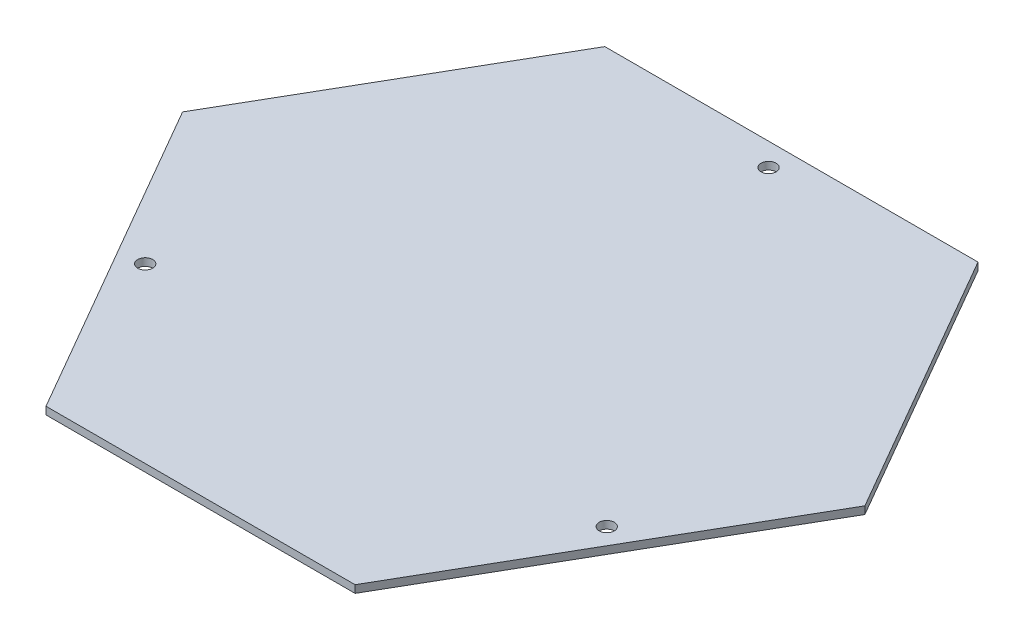
ISO-10303-21;
HEADER;
FILE_DESCRIPTION(('STEP AP214'),'2;1');
FILE_NAME('part.step','',(''),(''),'','','');
FILE_SCHEMA(('AUTOMOTIVE_DESIGN { 1 0 10303 214 1 1 1 1 }'));
ENDSEC;
DATA;
#1=APPLICATION_CONTEXT('core data for automotive mechanical design processes');
#2=APPLICATION_PROTOCOL_DEFINITION('international standard','automotive_design',2000,#1);
#3=PRODUCT_CONTEXT('',#1,'mechanical');
#4=PRODUCT('Part','Part','',(#3));
#5=PRODUCT_RELATED_PRODUCT_CATEGORY('part','',(#4));
#6=PRODUCT_DEFINITION_FORMATION('','',#4);
#7=PRODUCT_DEFINITION_CONTEXT('part definition',#1,'design');
#8=PRODUCT_DEFINITION('design','',#6,#7);
#9=PRODUCT_DEFINITION_SHAPE('','',#8);
#10=(LENGTH_UNIT() NAMED_UNIT(*) SI_UNIT(.MILLI.,.METRE.));
#11=(NAMED_UNIT(*) PLANE_ANGLE_UNIT() SI_UNIT($,.RADIAN.));
#12=(NAMED_UNIT(*) SI_UNIT($,.STERADIAN.) SOLID_ANGLE_UNIT());
#13=UNCERTAINTY_MEASURE_WITH_UNIT(LENGTH_MEASURE(1.E-05),#10,'distance_accuracy_value','');
#14=(GEOMETRIC_REPRESENTATION_CONTEXT(3) GLOBAL_UNCERTAINTY_ASSIGNED_CONTEXT((#13)) GLOBAL_UNIT_ASSIGNED_CONTEXT((#10,
#11,#12)) REPRESENTATION_CONTEXT('',''));
#15=CARTESIAN_POINT('',(0.,0.,0.));
#16=DIRECTION('',(0.,0.,1.));
#17=DIRECTION('',(1.,0.,0.));
#18=AXIS2_PLACEMENT_3D('',#15,#16,#17);
#19=CARTESIAN_POINT('',(0.,5.,0.));
#20=DIRECTION('',(0.866025403784436,0.,-0.500000000000004));
#21=DIRECTION('',(-0.500000000000004,0.,-0.866025403784436));
#22=AXIS2_PLACEMENT_3D('',#19,#20,#21);
#23=PLANE('',#22);
#24=DIRECTION('',(0.500000000000004,0.,0.866025403784436));
#25=VECTOR('',#24,1.);
#26=CARTESIAN_POINT('',(0.,0.,0.));
#27=LINE('',#26,#25);
#28=CARTESIAN_POINT('',(-123.750000000001,0.,-214.341287436648));
#29=VERTEX_POINT('',#28);
#30=CARTESIAN_POINT('',(0.,0.,0.));
#31=VERTEX_POINT('',#30);
#32=EDGE_CURVE('E129',#29,#31,#27,.T.);
#33=ORIENTED_EDGE('',*,*,#32,.T.);
#34=DIRECTION('',(0.,-1.,0.));
#35=VECTOR('',#34,1.);
#36=CARTESIAN_POINT('',(0.,5.,0.));
#37=LINE('',#36,#35);
#38=CARTESIAN_POINT('',(0.,5.,0.));
#39=VERTEX_POINT('',#38);
#40=EDGE_CURVE('E11',#39,#31,#37,.T.);
#41=ORIENTED_EDGE('',*,*,#40,.F.);
#42=DIRECTION('',(0.500000000000004,0.,0.866025403784436));
#43=VECTOR('',#42,1.);
#44=CARTESIAN_POINT('',(0.,5.,0.));
#45=LINE('',#44,#43);
#46=CARTESIAN_POINT('',(-123.750000000001,5.,-214.341287436648));
#47=VERTEX_POINT('',#46);
#48=EDGE_CURVE('E145',#47,#39,#45,.T.);
#49=ORIENTED_EDGE('',*,*,#48,.F.);
#50=DIRECTION('',(0.,-1.,0.));
#51=VECTOR('',#50,1.);
#52=CARTESIAN_POINT('',(-123.750000000001,5.,-214.341287436648));
#53=LINE('',#52,#51);
#54=EDGE_CURVE('E125',#47,#29,#53,.T.);
#55=ORIENTED_EDGE('',*,*,#54,.T.);
#56=EDGE_LOOP('',(#33,#41,#49,#55));
#57=FACE_BOUND('',#56,.T.);
#58=ADVANCED_FACE('F38',(#57),#23,.F.);
#59=CARTESIAN_POINT('',(0.,5.,0.));
#60=DIRECTION('',(0.,0.,-1.));
#61=DIRECTION('',(-1.,0.,0.));
#62=AXIS2_PLACEMENT_3D('',#59,#60,#61);
#63=PLANE('',#62);
#64=DIRECTION('',(1.,0.,0.));
#65=VECTOR('',#64,1.);
#66=CARTESIAN_POINT('',(0.,0.,0.));
#67=LINE('',#66,#65);
#68=CARTESIAN_POINT('',(205.,0.,0.));
#69=VERTEX_POINT('',#68);
#70=EDGE_CURVE('E133',#31,#69,#67,.T.);
#71=ORIENTED_EDGE('',*,*,#70,.T.);
#72=DIRECTION('',(0.,-1.,0.));
#73=VECTOR('',#72,1.);
#74=CARTESIAN_POINT('',(205.,5.,0.));
#75=LINE('',#74,#73);
#76=CARTESIAN_POINT('',(205.,5.,0.));
#77=VERTEX_POINT('',#76);
#78=EDGE_CURVE('E48',#77,#69,#75,.T.);
#79=ORIENTED_EDGE('',*,*,#78,.F.);
#80=DIRECTION('',(1.,0.,0.));
#81=VECTOR('',#80,1.);
#82=CARTESIAN_POINT('',(0.,5.,0.));
#83=LINE('',#82,#81);
#84=EDGE_CURVE('E94',#39,#77,#83,.T.);
#85=ORIENTED_EDGE('',*,*,#84,.F.);
#86=ORIENTED_EDGE('',*,*,#40,.T.);
#87=EDGE_LOOP('',(#71,#79,#85,#86));
#88=FACE_BOUND('',#87,.T.);
#89=ADVANCED_FACE('F196',(#88),#63,.F.);
#90=CARTESIAN_POINT('',(205.,5.,0.));
#91=DIRECTION('',(-0.86602540378444,0.,-0.499999999999998));
#92=DIRECTION('',(-0.499999999999998,0.,0.86602540378444));
#93=AXIS2_PLACEMENT_3D('',#90,#91,#92);
#94=PLANE('',#93);
#95=DIRECTION('',(0.499999999999998,0.,-0.86602540378444));
#96=VECTOR('',#95,1.);
#97=CARTESIAN_POINT('',(205.,0.,0.));
#98=LINE('',#97,#96);
#99=CARTESIAN_POINT('',(328.749999999999,0.,-214.341287436649));
#100=VERTEX_POINT('',#99);
#101=EDGE_CURVE('E136',#69,#100,#98,.T.);
#102=ORIENTED_EDGE('',*,*,#101,.T.);
#103=DIRECTION('',(0.,-1.,0.));
#104=VECTOR('',#103,1.);
#105=CARTESIAN_POINT('',(328.749999999999,5.,-214.341287436649));
#106=LINE('',#105,#104);
#107=CARTESIAN_POINT('',(328.749999999999,5.,-214.341287436649));
#108=VERTEX_POINT('',#107);
#109=EDGE_CURVE('E118',#108,#100,#106,.T.);
#110=ORIENTED_EDGE('',*,*,#109,.F.);
#111=DIRECTION('',(0.499999999999998,0.,-0.86602540378444));
#112=VECTOR('',#111,1.);
#113=CARTESIAN_POINT('',(205.,5.,0.));
#114=LINE('',#113,#112);
#115=EDGE_CURVE('E107',#77,#108,#114,.T.);
#116=ORIENTED_EDGE('',*,*,#115,.F.);
#117=ORIENTED_EDGE('',*,*,#78,.T.);
#118=EDGE_LOOP('',(#102,#110,#116,#117));
#119=FACE_BOUND('',#118,.T.);
#120=ADVANCED_FACE('F200',(#119),#94,.F.);
#121=CARTESIAN_POINT('',(328.749999999999,5.,-214.341287436649));
#122=DIRECTION('',(-0.866025403784437,0.,0.500000000000003));
#123=DIRECTION('',(0.500000000000003,0.,0.866025403784437));
#124=AXIS2_PLACEMENT_3D('',#121,#122,#123);
#125=PLANE('',#124);
#126=DIRECTION('',(-0.500000000000003,0.,-0.866025403784437));
#127=VECTOR('',#126,1.);
#128=CARTESIAN_POINT('',(328.749999999999,0.,-214.341287436649));
#129=LINE('',#128,#127);
#130=CARTESIAN_POINT('',(226.249999999999,0.,-391.876495212458));
#131=VERTEX_POINT('',#130);
#132=EDGE_CURVE('E116',#100,#131,#129,.T.);
#133=ORIENTED_EDGE('',*,*,#132,.T.);
#134=DIRECTION('',(0.,-1.,0.));
#135=VECTOR('',#134,1.);
#136=CARTESIAN_POINT('',(226.249999999999,5.,-391.876495212458));
#137=LINE('',#136,#135);
#138=CARTESIAN_POINT('',(226.249999999999,5.,-391.876495212458));
#139=VERTEX_POINT('',#138);
#140=EDGE_CURVE('E113',#139,#131,#137,.T.);
#141=ORIENTED_EDGE('',*,*,#140,.F.);
#142=DIRECTION('',(-0.500000000000003,0.,-0.866025403784437));
#143=VECTOR('',#142,1.);
#144=CARTESIAN_POINT('',(328.749999999999,5.,-214.341287436649));
#145=LINE('',#144,#143);
#146=EDGE_CURVE('E101',#108,#139,#145,.T.);
#147=ORIENTED_EDGE('',*,*,#146,.F.);
#148=ORIENTED_EDGE('',*,*,#109,.T.);
#149=EDGE_LOOP('',(#133,#141,#147,#148));
#150=FACE_BOUND('',#149,.T.);
#151=ADVANCED_FACE('F114',(#150),#125,.F.);
#152=CARTESIAN_POINT('',(-21.2500000000005,5.,-391.876495212459));
#153=DIRECTION('',(0.,0.,1.));
#154=DIRECTION('',(1.,0.,0.));
#155=AXIS2_PLACEMENT_3D('',#152,#153,#154);
#156=PLANE('',#155);
#157=DIRECTION('',(-1.,0.,0.));
#158=VECTOR('',#157,1.);
#159=CARTESIAN_POINT('',(-21.2500000000005,0.,-391.876495212459));
#160=LINE('',#159,#158);
#161=CARTESIAN_POINT('',(-21.2500000000005,0.,-391.876495212459));
#162=VERTEX_POINT('',#161);
#163=EDGE_CURVE('E80',#131,#162,#160,.T.);
#164=ORIENTED_EDGE('',*,*,#163,.T.);
#165=DIRECTION('',(0.,-1.,0.));
#166=VECTOR('',#165,1.);
#167=CARTESIAN_POINT('',(-21.2500000000005,5.,-391.876495212459));
#168=LINE('',#167,#166);
#169=CARTESIAN_POINT('',(-21.2500000000005,5.,-391.876495212459));
#170=VERTEX_POINT('',#169);
#171=EDGE_CURVE('E119',#170,#162,#168,.T.);
#172=ORIENTED_EDGE('',*,*,#171,.F.);
#173=DIRECTION('',(-1.,0.,0.));
#174=VECTOR('',#173,1.);
#175=CARTESIAN_POINT('',(-21.2500000000005,5.,-391.876495212459));
#176=LINE('',#175,#174);
#177=EDGE_CURVE('E105',#139,#170,#176,.T.);
#178=ORIENTED_EDGE('',*,*,#177,.F.);
#179=ORIENTED_EDGE('',*,*,#140,.T.);
#180=EDGE_LOOP('',(#164,#172,#178,#179));
#181=FACE_BOUND('',#180,.T.);
#182=ADVANCED_FACE('F121',(#181),#156,.F.);
#183=CARTESIAN_POINT('',(-123.750000000001,5.,-214.341287436648));
#184=DIRECTION('',(0.866025403784438,0.,0.5));
#185=DIRECTION('',(0.5,0.,-0.866025403784439));
#186=AXIS2_PLACEMENT_3D('',#183,#184,#185);
#187=PLANE('',#186);
#188=DIRECTION('',(-0.5,0.,0.866025403784439));
#189=VECTOR('',#188,1.);
#190=CARTESIAN_POINT('',(-123.750000000001,0.,-214.341287436648));
#191=LINE('',#190,#189);
#192=EDGE_CURVE('E86',#162,#29,#191,.T.);
#193=ORIENTED_EDGE('',*,*,#192,.T.);
#194=ORIENTED_EDGE('',*,*,#54,.F.);
#195=DIRECTION('',(-0.5,0.,0.866025403784439));
#196=VECTOR('',#195,1.);
#197=CARTESIAN_POINT('',(-123.750000000001,5.,-214.341287436648));
#198=LINE('',#197,#196);
#199=EDGE_CURVE('E57',#170,#47,#198,.T.);
#200=ORIENTED_EDGE('',*,*,#199,.F.);
#201=ORIENTED_EDGE('',*,*,#171,.T.);
#202=EDGE_LOOP('',(#193,#194,#200,#201));
#203=FACE_BOUND('',#202,.T.);
#204=ADVANCED_FACE('F184',(#203),#187,.F.);
#205=CARTESIAN_POINT('',(0.,5.,0.));
#206=DIRECTION('',(0.,-1.,0.));
#207=DIRECTION('',(0.,0.,-1.));
#208=AXIS2_PLACEMENT_3D('',#205,#206,#207);
#209=PLANE('',#208);
#210=CARTESIAN_POINT('',(-48.8846189432339,5.,-114.670643718324));
#211=DIRECTION('',(0.,1.,0.));
#212=DIRECTION('',(0.,0.,1.));
#213=AXIS2_PLACEMENT_3D('',#210,#211,#212);
#214=CIRCLE('',#213,5.);
#215=CARTESIAN_POINT('',(-48.8846189432339,5.,-109.670643718324));
#216=VERTEX_POINT('',#215);
#217=EDGE_CURVE('E159',#216,#216,#214,.T.);
#218=ORIENTED_EDGE('',*,*,#217,.F.);
#219=EDGE_LOOP('',(#218));
#220=FACE_BOUND('',#219,.T.);
#221=CARTESIAN_POINT('',(102.499999999999,5.,-376.721050646231));
#222=DIRECTION('',(0.,1.,0.));
#223=DIRECTION('',(0.,0.,1.));
#224=AXIS2_PLACEMENT_3D('',#221,#222,#223);
#225=CIRCLE('',#224,5.00000000000001);
#226=CARTESIAN_POINT('',(102.499999999999,5.,-371.721050646231));
#227=VERTEX_POINT('',#226);
#228=EDGE_CURVE('E260',#227,#227,#225,.T.);
#229=ORIENTED_EDGE('',*,*,#228,.F.);
#230=EDGE_LOOP('',(#229));
#231=FACE_BOUND('',#230,.T.);
#232=CARTESIAN_POINT('',(255.08272675985,5.,-116.819354836947));
#233=DIRECTION('',(0.,1.,0.));
#234=DIRECTION('',(0.,0.,1.));
#235=AXIS2_PLACEMENT_3D('',#232,#233,#234);
#236=CIRCLE('',#235,4.99999999999999);
#237=CARTESIAN_POINT('',(255.08272675985,5.,-111.819354836947));
#238=VERTEX_POINT('',#237);
#239=EDGE_CURVE('E263',#238,#238,#236,.T.);
#240=ORIENTED_EDGE('',*,*,#239,.F.);
#241=EDGE_LOOP('',(#240));
#242=FACE_BOUND('',#241,.T.);
#243=ORIENTED_EDGE('',*,*,#48,.T.);
#244=ORIENTED_EDGE('',*,*,#84,.T.);
#245=ORIENTED_EDGE('',*,*,#115,.T.);
#246=ORIENTED_EDGE('',*,*,#146,.T.);
#247=ORIENTED_EDGE('',*,*,#177,.T.);
#248=ORIENTED_EDGE('',*,*,#199,.T.);
#249=EDGE_LOOP('',(#243,#244,#245,#246,#247,#248));
#250=FACE_BOUND('',#249,.T.);
#251=ADVANCED_FACE('F103',(#220,#231,#242,#250),#209,.F.);
#252=CARTESIAN_POINT('',(0.,0.,0.));
#253=DIRECTION('',(0.,-1.,0.));
#254=DIRECTION('',(0.,0.,-1.));
#255=AXIS2_PLACEMENT_3D('',#252,#253,#254);
#256=PLANE('',#255);
#257=CARTESIAN_POINT('',(-48.8846189432339,0.,-114.670643718324));
#258=DIRECTION('',(0.,-1.,0.));
#259=DIRECTION('',(0.,0.,-1.));
#260=AXIS2_PLACEMENT_3D('',#257,#258,#259);
#261=CIRCLE('',#260,5.);
#262=CARTESIAN_POINT('',(-48.8846189432339,0.,-119.670643718324));
#263=VERTEX_POINT('',#262);
#264=EDGE_CURVE('E41',#263,#263,#261,.T.);
#265=ORIENTED_EDGE('',*,*,#264,.F.);
#266=EDGE_LOOP('',(#265));
#267=FACE_BOUND('',#266,.T.);
#268=CARTESIAN_POINT('',(102.499999999999,0.,-376.721050646231));
#269=DIRECTION('',(0.,-1.,0.));
#270=DIRECTION('',(0.,0.,-1.));
#271=AXIS2_PLACEMENT_3D('',#268,#269,#270);
#272=CIRCLE('',#271,5.00000000000001);
#273=CARTESIAN_POINT('',(102.499999999999,0.,-381.721050646231));
#274=VERTEX_POINT('',#273);
#275=EDGE_CURVE('E158',#274,#274,#272,.T.);
#276=ORIENTED_EDGE('',*,*,#275,.F.);
#277=EDGE_LOOP('',(#276));
#278=FACE_BOUND('',#277,.T.);
#279=CARTESIAN_POINT('',(255.08272675985,0.,-116.819354836947));
#280=DIRECTION('',(0.,-1.,0.));
#281=DIRECTION('',(0.,0.,-1.));
#282=AXIS2_PLACEMENT_3D('',#279,#280,#281);
#283=CIRCLE('',#282,4.99999999999999);
#284=CARTESIAN_POINT('',(255.08272675985,0.,-121.819354836947));
#285=VERTEX_POINT('',#284);
#286=EDGE_CURVE('E155',#285,#285,#283,.T.);
#287=ORIENTED_EDGE('',*,*,#286,.F.);
#288=EDGE_LOOP('',(#287));
#289=FACE_BOUND('',#288,.T.);
#290=ORIENTED_EDGE('',*,*,#32,.F.);
#291=ORIENTED_EDGE('',*,*,#192,.F.);
#292=ORIENTED_EDGE('',*,*,#163,.F.);
#293=ORIENTED_EDGE('',*,*,#132,.F.);
#294=ORIENTED_EDGE('',*,*,#101,.F.);
#295=ORIENTED_EDGE('',*,*,#70,.F.);
#296=EDGE_LOOP('',(#290,#291,#292,#293,#294,#295));
#297=FACE_BOUND('',#296,.T.);
#298=ADVANCED_FACE('F171',(#267,#278,#289,#297),#256,.T.);
#299=CARTESIAN_POINT('',(255.08272675985,-5.,-116.819354836947));
#300=DIRECTION('',(0.,1.,0.));
#301=DIRECTION('',(0.,0.,1.));
#302=AXIS2_PLACEMENT_3D('',#299,#300,#301);
#303=CYLINDRICAL_SURFACE('',#302,4.99999999999999);
#304=ORIENTED_EDGE('',*,*,#286,.T.);
#305=EDGE_LOOP('',(#304));
#306=FACE_BOUND('',#305,.T.);
#307=ORIENTED_EDGE('',*,*,#239,.T.);
#308=EDGE_LOOP('',(#307));
#309=FACE_BOUND('',#308,.T.);
#310=ADVANCED_FACE('F174',(#306,#309),#303,.F.);
#311=CARTESIAN_POINT('',(102.499999999999,-5.,-376.721050646231));
#312=DIRECTION('',(0.,1.,0.));
#313=DIRECTION('',(0.,0.,1.));
#314=AXIS2_PLACEMENT_3D('',#311,#312,#313);
#315=CYLINDRICAL_SURFACE('',#314,5.00000000000001);
#316=ORIENTED_EDGE('',*,*,#275,.T.);
#317=EDGE_LOOP('',(#316));
#318=FACE_BOUND('',#317,.T.);
#319=ORIENTED_EDGE('',*,*,#228,.T.);
#320=EDGE_LOOP('',(#319));
#321=FACE_BOUND('',#320,.T.);
#322=ADVANCED_FACE('F236',(#318,#321),#315,.F.);
#323=CARTESIAN_POINT('',(-48.8846189432339,-5.,-114.670643718324));
#324=DIRECTION('',(0.,1.,0.));
#325=DIRECTION('',(0.,0.,1.));
#326=AXIS2_PLACEMENT_3D('',#323,#324,#325);
#327=CYLINDRICAL_SURFACE('',#326,5.);
#328=ORIENTED_EDGE('',*,*,#264,.T.);
#329=EDGE_LOOP('',(#328));
#330=FACE_BOUND('',#329,.T.);
#331=ORIENTED_EDGE('',*,*,#217,.T.);
#332=EDGE_LOOP('',(#331));
#333=FACE_BOUND('',#332,.T.);
#334=ADVANCED_FACE('F168',(#330,#333),#327,.F.);
#335=CLOSED_SHELL('',(#58,#89,#120,#151,#182,#204,#251,#298,#310,#322,#334));
#336=MANIFOLD_SOLID_BREP('B2',#335);
#337=ADVANCED_BREP_SHAPE_REPRESENTATION('',(#18,#336),#14);
#338=SHAPE_DEFINITION_REPRESENTATION(#9,#337);
ENDSEC;
END-ISO-10303-21;
